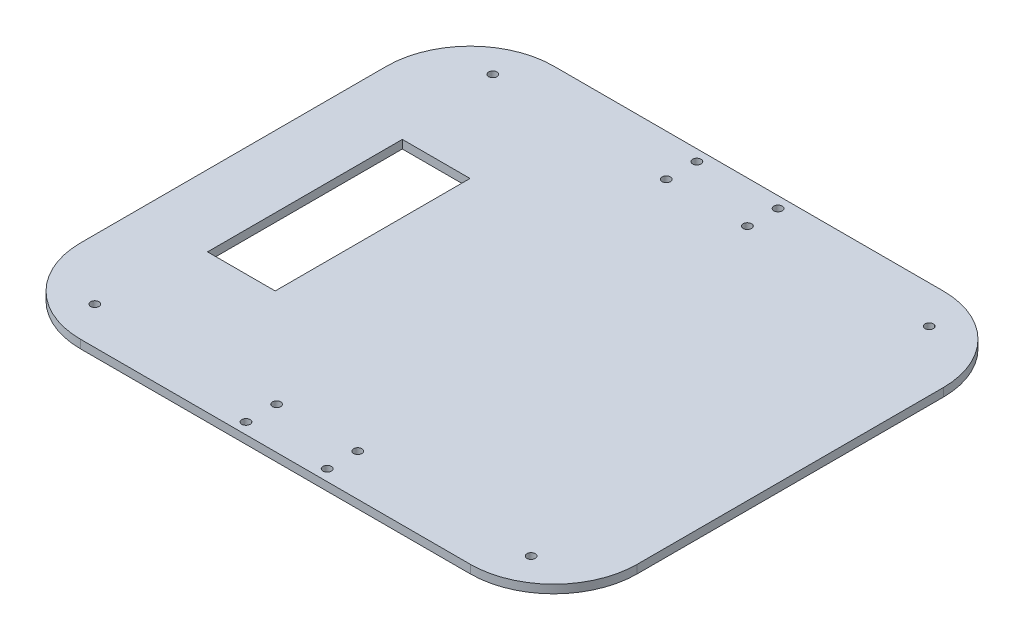
ISO-10303-21;
HEADER;
FILE_DESCRIPTION(('STEP AP214'),'2;1');
FILE_NAME('part.step','',(''),(''),'','','');
FILE_SCHEMA(('AUTOMOTIVE_DESIGN { 1 0 10303 214 1 1 1 1 }'));
ENDSEC;
DATA;
#1=APPLICATION_CONTEXT('core data for automotive mechanical design processes');
#2=APPLICATION_PROTOCOL_DEFINITION('international standard','automotive_design',2000,#1);
#3=PRODUCT_CONTEXT('',#1,'mechanical');
#4=PRODUCT('Part','Part','',(#3));
#5=PRODUCT_RELATED_PRODUCT_CATEGORY('part','',(#4));
#6=PRODUCT_DEFINITION_FORMATION('','',#4);
#7=PRODUCT_DEFINITION_CONTEXT('part definition',#1,'design');
#8=PRODUCT_DEFINITION('design','',#6,#7);
#9=PRODUCT_DEFINITION_SHAPE('','',#8);
#10=(LENGTH_UNIT() NAMED_UNIT(*) SI_UNIT(.MILLI.,.METRE.));
#11=(NAMED_UNIT(*) PLANE_ANGLE_UNIT() SI_UNIT($,.RADIAN.));
#12=(NAMED_UNIT(*) SI_UNIT($,.STERADIAN.) SOLID_ANGLE_UNIT());
#13=UNCERTAINTY_MEASURE_WITH_UNIT(LENGTH_MEASURE(1.E-05),#10,'distance_accuracy_value','');
#14=(GEOMETRIC_REPRESENTATION_CONTEXT(3) GLOBAL_UNCERTAINTY_ASSIGNED_CONTEXT((#13)) GLOBAL_UNIT_ASSIGNED_CONTEXT((#10,
#11,#12)) REPRESENTATION_CONTEXT('',''));
#15=CARTESIAN_POINT('',(0.,0.,0.));
#16=DIRECTION('',(0.,0.,1.));
#17=DIRECTION('',(1.,0.,0.));
#18=AXIS2_PLACEMENT_3D('',#15,#16,#17);
#19=CARTESIAN_POINT('',(100.,3.,-85.));
#20=DIRECTION('',(-1.,0.,0.));
#21=DIRECTION('',(0.,0.,1.));
#22=AXIS2_PLACEMENT_3D('',#19,#20,#21);
#23=PLANE('',#22);
#24=DIRECTION('',(0.,0.,-1.));
#25=VECTOR('',#24,1.);
#26=CARTESIAN_POINT('',(100.,0.,-85.));
#27=LINE('',#26,#25);
#28=CARTESIAN_POINT('',(100.,0.,55.));
#29=VERTEX_POINT('',#28);
#30=CARTESIAN_POINT('',(100.,0.,-55.));
#31=VERTEX_POINT('',#30);
#32=EDGE_CURVE('E158',#29,#31,#27,.T.);
#33=ORIENTED_EDGE('',*,*,#32,.T.);
#34=DIRECTION('',(0.,-1.,0.));
#35=VECTOR('',#34,1.);
#36=CARTESIAN_POINT('',(100.,3.,-55.));
#37=LINE('',#36,#35);
#38=CARTESIAN_POINT('',(100.,3.,-55.));
#39=VERTEX_POINT('',#38);
#40=EDGE_CURVE('E11',#31,#39,#37,.F.);
#41=ORIENTED_EDGE('',*,*,#40,.T.);
#42=DIRECTION('',(0.,0.,-1.));
#43=VECTOR('',#42,1.);
#44=CARTESIAN_POINT('',(100.,3.,-85.));
#45=LINE('',#44,#43);
#46=CARTESIAN_POINT('',(100.,3.,55.));
#47=VERTEX_POINT('',#46);
#48=EDGE_CURVE('E161',#47,#39,#45,.T.);
#49=ORIENTED_EDGE('',*,*,#48,.F.);
#50=DIRECTION('',(0.,-1.,0.));
#51=VECTOR('',#50,1.);
#52=CARTESIAN_POINT('',(100.,3.,55.));
#53=LINE('',#52,#51);
#54=EDGE_CURVE('E44',#47,#29,#53,.T.);
#55=ORIENTED_EDGE('',*,*,#54,.T.);
#56=EDGE_LOOP('',(#33,#41,#49,#55));
#57=FACE_BOUND('',#56,.T.);
#58=ADVANCED_FACE('F36',(#57),#23,.F.);
#59=CARTESIAN_POINT('',(-100.,3.,-85.));
#60=DIRECTION('',(0.,0.,1.));
#61=DIRECTION('',(1.,0.,0.));
#62=AXIS2_PLACEMENT_3D('',#59,#60,#61);
#63=PLANE('',#62);
#64=DIRECTION('',(-1.,0.,0.));
#65=VECTOR('',#64,1.);
#66=CARTESIAN_POINT('',(-100.,0.,-85.));
#67=LINE('',#66,#65);
#68=CARTESIAN_POINT('',(70.,0.,-85.));
#69=VERTEX_POINT('',#68);
#70=CARTESIAN_POINT('',(-70.,0.,-85.));
#71=VERTEX_POINT('',#70);
#72=EDGE_CURVE('E175',#69,#71,#67,.T.);
#73=ORIENTED_EDGE('',*,*,#72,.T.);
#74=DIRECTION('',(0.,-1.,0.));
#75=VECTOR('',#74,1.);
#76=CARTESIAN_POINT('',(-70.,3.,-85.));
#77=LINE('',#76,#75);
#78=CARTESIAN_POINT('',(-70.,3.,-85.));
#79=VERTEX_POINT('',#78);
#80=EDGE_CURVE('E51',#71,#79,#77,.F.);
#81=ORIENTED_EDGE('',*,*,#80,.T.);
#82=DIRECTION('',(-1.,0.,0.));
#83=VECTOR('',#82,1.);
#84=CARTESIAN_POINT('',(-100.,3.,-85.));
#85=LINE('',#84,#83);
#86=CARTESIAN_POINT('',(70.,3.,-85.));
#87=VERTEX_POINT('',#86);
#88=EDGE_CURVE('E163',#87,#79,#85,.T.);
#89=ORIENTED_EDGE('',*,*,#88,.F.);
#90=DIRECTION('',(0.,-1.,0.));
#91=VECTOR('',#90,1.);
#92=CARTESIAN_POINT('',(70.,3.,-85.));
#93=LINE('',#92,#91);
#94=EDGE_CURVE('E254',#87,#69,#93,.T.);
#95=ORIENTED_EDGE('',*,*,#94,.T.);
#96=EDGE_LOOP('',(#73,#81,#89,#95));
#97=FACE_BOUND('',#96,.T.);
#98=ADVANCED_FACE('F272',(#97),#63,.F.);
#99=CARTESIAN_POINT('',(-100.,3.,-85.));
#100=DIRECTION('',(1.,0.,0.));
#101=DIRECTION('',(0.,0.,-1.));
#102=AXIS2_PLACEMENT_3D('',#99,#100,#101);
#103=PLANE('',#102);
#104=DIRECTION('',(0.,0.,1.));
#105=VECTOR('',#104,1.);
#106=CARTESIAN_POINT('',(-100.,0.,-85.));
#107=LINE('',#106,#105);
#108=CARTESIAN_POINT('',(-100.,0.,-55.));
#109=VERTEX_POINT('',#108);
#110=CARTESIAN_POINT('',(-100.,0.,55.));
#111=VERTEX_POINT('',#110);
#112=EDGE_CURVE('E177',#109,#111,#107,.T.);
#113=ORIENTED_EDGE('',*,*,#112,.T.);
#114=DIRECTION('',(0.,-1.,0.));
#115=VECTOR('',#114,1.);
#116=CARTESIAN_POINT('',(-100.,3.,55.));
#117=LINE('',#116,#115);
#118=CARTESIAN_POINT('',(-100.,3.,55.));
#119=VERTEX_POINT('',#118);
#120=EDGE_CURVE('E245',#111,#119,#117,.F.);
#121=ORIENTED_EDGE('',*,*,#120,.T.);
#122=DIRECTION('',(0.,0.,1.));
#123=VECTOR('',#122,1.);
#124=CARTESIAN_POINT('',(-100.,3.,-85.));
#125=LINE('',#124,#123);
#126=CARTESIAN_POINT('',(-100.,3.,-55.));
#127=VERTEX_POINT('',#126);
#128=EDGE_CURVE('E166',#127,#119,#125,.T.);
#129=ORIENTED_EDGE('',*,*,#128,.F.);
#130=DIRECTION('',(0.,-1.,0.));
#131=VECTOR('',#130,1.);
#132=CARTESIAN_POINT('',(-100.,3.,-55.));
#133=LINE('',#132,#131);
#134=EDGE_CURVE('E242',#127,#109,#133,.T.);
#135=ORIENTED_EDGE('',*,*,#134,.T.);
#136=EDGE_LOOP('',(#113,#121,#129,#135));
#137=FACE_BOUND('',#136,.T.);
#138=ADVANCED_FACE('F280',(#137),#103,.F.);
#139=CARTESIAN_POINT('',(-100.,3.,85.));
#140=DIRECTION('',(0.,0.,-1.));
#141=DIRECTION('',(-1.,0.,0.));
#142=AXIS2_PLACEMENT_3D('',#139,#140,#141);
#143=PLANE('',#142);
#144=DIRECTION('',(1.,0.,0.));
#145=VECTOR('',#144,1.);
#146=CARTESIAN_POINT('',(-100.,3.,85.));
#147=LINE('',#146,#145);
#148=CARTESIAN_POINT('',(-70.,3.,85.));
#149=VERTEX_POINT('',#148);
#150=CARTESIAN_POINT('',(70.,3.,85.));
#151=VERTEX_POINT('',#150);
#152=EDGE_CURVE('E169',#149,#151,#147,.T.);
#153=ORIENTED_EDGE('',*,*,#152,.F.);
#154=DIRECTION('',(0.,-1.,0.));
#155=VECTOR('',#154,1.);
#156=CARTESIAN_POINT('',(-70.,3.,85.));
#157=LINE('',#156,#155);
#158=CARTESIAN_POINT('',(-70.,0.,85.));
#159=VERTEX_POINT('',#158);
#160=EDGE_CURVE('E231',#149,#159,#157,.T.);
#161=ORIENTED_EDGE('',*,*,#160,.T.);
#162=DIRECTION('',(1.,0.,0.));
#163=VECTOR('',#162,1.);
#164=CARTESIAN_POINT('',(-100.,0.,85.));
#165=LINE('',#164,#163);
#166=CARTESIAN_POINT('',(70.,0.,85.));
#167=VERTEX_POINT('',#166);
#168=EDGE_CURVE('E164',#159,#167,#165,.T.);
#169=ORIENTED_EDGE('',*,*,#168,.T.);
#170=DIRECTION('',(0.,-1.,0.));
#171=VECTOR('',#170,1.);
#172=CARTESIAN_POINT('',(70.,3.,85.));
#173=LINE('',#172,#171);
#174=EDGE_CURVE('E190',#167,#151,#173,.F.);
#175=ORIENTED_EDGE('',*,*,#174,.T.);
#176=EDGE_LOOP('',(#153,#161,#169,#175));
#177=FACE_BOUND('',#176,.T.);
#178=ADVANCED_FACE('F288',(#177),#143,.F.);
#179=CARTESIAN_POINT('',(0.,3.,0.));
#180=DIRECTION('',(0.,1.,0.));
#181=DIRECTION('',(0.,0.,1.));
#182=AXIS2_PLACEMENT_3D('',#179,#180,#181);
#183=PLANE('',#182);
#184=CARTESIAN_POINT('',(-14.58,3.,-81.));
#185=DIRECTION('',(0.,1.,0.));
#186=DIRECTION('',(0.,0.,-1.));
#187=AXIS2_PLACEMENT_3D('',#184,#185,#186);
#188=CIRCLE('',#187,1.5);
#189=CARTESIAN_POINT('',(-14.58,3.,-82.5));
#190=VERTEX_POINT('',#189);
#191=EDGE_CURVE('E543',#190,#190,#188,.T.);
#192=ORIENTED_EDGE('',*,*,#191,.F.);
#193=EDGE_LOOP('',(#192));
#194=FACE_BOUND('',#193,.T.);
#195=CARTESIAN_POINT('',(14.5800000000001,3.,70.));
#196=DIRECTION('',(0.,1.,0.));
#197=DIRECTION('',(0.,0.,1.));
#198=AXIS2_PLACEMENT_3D('',#195,#196,#197);
#199=CIRCLE('',#198,1.5);
#200=CARTESIAN_POINT('',(14.5800000000001,3.,71.5));
#201=VERTEX_POINT('',#200);
#202=EDGE_CURVE('E547',#201,#201,#199,.T.);
#203=ORIENTED_EDGE('',*,*,#202,.F.);
#204=EDGE_LOOP('',(#203));
#205=FACE_BOUND('',#204,.T.);
#206=CARTESIAN_POINT('',(-14.58,3.,70.));
#207=DIRECTION('',(0.,1.,0.));
#208=DIRECTION('',(0.,0.,-1.));
#209=AXIS2_PLACEMENT_3D('',#206,#207,#208);
#210=CIRCLE('',#209,1.5);
#211=CARTESIAN_POINT('',(-14.58,3.,68.5));
#212=VERTEX_POINT('',#211);
#213=EDGE_CURVE('E551',#212,#212,#210,.T.);
#214=ORIENTED_EDGE('',*,*,#213,.F.);
#215=EDGE_LOOP('',(#214));
#216=FACE_BOUND('',#215,.T.);
#217=CARTESIAN_POINT('',(14.5800000000001,3.,81.));
#218=DIRECTION('',(0.,1.,0.));
#219=DIRECTION('',(0.,0.,-1.));
#220=AXIS2_PLACEMENT_3D('',#217,#218,#219);
#221=CIRCLE('',#220,1.5);
#222=CARTESIAN_POINT('',(14.5800000000001,3.,79.5));
#223=VERTEX_POINT('',#222);
#224=EDGE_CURVE('E555',#223,#223,#221,.T.);
#225=ORIENTED_EDGE('',*,*,#224,.F.);
#226=EDGE_LOOP('',(#225));
#227=FACE_BOUND('',#226,.T.);
#228=CARTESIAN_POINT('',(14.5800000000001,3.,-70.));
#229=DIRECTION('',(0.,1.,0.));
#230=DIRECTION('',(0.,0.,-1.));
#231=AXIS2_PLACEMENT_3D('',#228,#229,#230);
#232=CIRCLE('',#231,1.5);
#233=CARTESIAN_POINT('',(14.5800000000001,3.,-71.5));
#234=VERTEX_POINT('',#233);
#235=EDGE_CURVE('E559',#234,#234,#232,.T.);
#236=ORIENTED_EDGE('',*,*,#235,.F.);
#237=EDGE_LOOP('',(#236));
#238=FACE_BOUND('',#237,.T.);
#239=CARTESIAN_POINT('',(14.5800000000001,3.,-81.));
#240=DIRECTION('',(0.,1.,0.));
#241=DIRECTION('',(0.,0.,1.));
#242=AXIS2_PLACEMENT_3D('',#239,#240,#241);
#243=CIRCLE('',#242,1.5);
#244=CARTESIAN_POINT('',(14.5800000000001,3.,-79.5));
#245=VERTEX_POINT('',#244);
#246=EDGE_CURVE('E563',#245,#245,#243,.T.);
#247=ORIENTED_EDGE('',*,*,#246,.F.);
#248=EDGE_LOOP('',(#247));
#249=FACE_BOUND('',#248,.T.);
#250=CARTESIAN_POINT('',(-14.58,3.,-70.));
#251=DIRECTION('',(0.,1.,0.));
#252=DIRECTION('',(0.,0.,1.));
#253=AXIS2_PLACEMENT_3D('',#250,#251,#252);
#254=CIRCLE('',#253,1.5);
#255=CARTESIAN_POINT('',(-14.58,3.,-68.5));
#256=VERTEX_POINT('',#255);
#257=EDGE_CURVE('E567',#256,#256,#254,.T.);
#258=ORIENTED_EDGE('',*,*,#257,.F.);
#259=EDGE_LOOP('',(#258));
#260=FACE_BOUND('',#259,.T.);
#261=CARTESIAN_POINT('',(-14.58,3.,81.));
#262=DIRECTION('',(0.,1.,0.));
#263=DIRECTION('',(0.,0.,1.));
#264=AXIS2_PLACEMENT_3D('',#261,#262,#263);
#265=CIRCLE('',#264,1.5);
#266=CARTESIAN_POINT('',(-14.58,3.,82.5));
#267=VERTEX_POINT('',#266);
#268=EDGE_CURVE('E208',#267,#267,#265,.T.);
#269=ORIENTED_EDGE('',*,*,#268,.F.);
#270=EDGE_LOOP('',(#269));
#271=FACE_BOUND('',#270,.T.);
#272=CARTESIAN_POINT('',(78.3800000000001,3.,71.5));
#273=DIRECTION('',(0.,1.,0.));
#274=DIRECTION('',(0.,0.,-1.));
#275=AXIS2_PLACEMENT_3D('',#272,#273,#274);
#276=CIRCLE('',#275,1.5);
#277=CARTESIAN_POINT('',(78.3800000000001,3.,70.));
#278=VERTEX_POINT('',#277);
#279=EDGE_CURVE('E229',#278,#278,#276,.T.);
#280=ORIENTED_EDGE('',*,*,#279,.F.);
#281=EDGE_LOOP('',(#280));
#282=FACE_BOUND('',#281,.T.);
#283=CARTESIAN_POINT('',(78.38,3.,-71.5000000000001));
#284=DIRECTION('',(0.,1.,0.));
#285=DIRECTION('',(0.,0.,1.));
#286=AXIS2_PLACEMENT_3D('',#283,#284,#285);
#287=CIRCLE('',#286,1.5);
#288=CARTESIAN_POINT('',(78.38,3.,-70.0000000000001));
#289=VERTEX_POINT('',#288);
#290=EDGE_CURVE('E577',#289,#289,#287,.T.);
#291=ORIENTED_EDGE('',*,*,#290,.F.);
#292=EDGE_LOOP('',(#291));
#293=FACE_BOUND('',#292,.T.);
#294=CARTESIAN_POINT('',(-78.38,3.,-71.5));
#295=DIRECTION('',(0.,1.,0.));
#296=DIRECTION('',(0.,0.,-1.));
#297=AXIS2_PLACEMENT_3D('',#294,#295,#296);
#298=CIRCLE('',#297,1.5);
#299=CARTESIAN_POINT('',(-78.38,3.,-73.));
#300=VERTEX_POINT('',#299);
#301=EDGE_CURVE('E581',#300,#300,#298,.T.);
#302=ORIENTED_EDGE('',*,*,#301,.F.);
#303=EDGE_LOOP('',(#302));
#304=FACE_BOUND('',#303,.T.);
#305=CARTESIAN_POINT('',(-78.38,3.,71.5));
#306=DIRECTION('',(0.,1.,0.));
#307=DIRECTION('',(0.,0.,1.));
#308=AXIS2_PLACEMENT_3D('',#305,#306,#307);
#309=CIRCLE('',#308,1.5);
#310=CARTESIAN_POINT('',(-78.38,3.,73.));
#311=VERTEX_POINT('',#310);
#312=EDGE_CURVE('E195',#311,#311,#309,.T.);
#313=ORIENTED_EDGE('',*,*,#312,.F.);
#314=EDGE_LOOP('',(#313));
#315=FACE_BOUND('',#314,.T.);
#316=DIRECTION('',(0.,0.,-1.));
#317=VECTOR('',#316,1.);
#318=CARTESIAN_POINT('',(-50.0787742574857,3.,-34.9999999999999));
#319=LINE('',#318,#317);
#320=CARTESIAN_POINT('',(-50.0787742574857,3.,35.0000000000001));
#321=VERTEX_POINT('',#320);
#322=CARTESIAN_POINT('',(-50.0787742574857,3.,-34.9999999999999));
#323=VERTEX_POINT('',#322);
#324=EDGE_CURVE('E147',#321,#323,#319,.T.);
#325=ORIENTED_EDGE('',*,*,#324,.F.);
#326=DIRECTION('',(1.,0.,0.));
#327=VECTOR('',#326,1.);
#328=CARTESIAN_POINT('',(-74.4006095549707,3.,35.0000000000001));
#329=LINE('',#328,#327);
#330=CARTESIAN_POINT('',(-74.4006095549707,3.,35.0000000000001));
#331=VERTEX_POINT('',#330);
#332=EDGE_CURVE('E151',#331,#321,#329,.T.);
#333=ORIENTED_EDGE('',*,*,#332,.F.);
#334=DIRECTION('',(0.,0.,1.));
#335=VECTOR('',#334,1.);
#336=CARTESIAN_POINT('',(-74.4006095549707,3.,-34.9999999999999));
#337=LINE('',#336,#335);
#338=CARTESIAN_POINT('',(-74.4006095549707,3.,-34.9999999999999));
#339=VERTEX_POINT('',#338);
#340=EDGE_CURVE('E131',#339,#331,#337,.T.);
#341=ORIENTED_EDGE('',*,*,#340,.F.);
#342=DIRECTION('',(-1.,0.,0.));
#343=VECTOR('',#342,1.);
#344=CARTESIAN_POINT('',(-74.4006095549707,3.,-34.9999999999999));
#345=LINE('',#344,#343);
#346=EDGE_CURVE('E142',#323,#339,#345,.T.);
#347=ORIENTED_EDGE('',*,*,#346,.F.);
#348=EDGE_LOOP('',(#325,#333,#341,#347));
#349=FACE_BOUND('',#348,.T.);
#350=ORIENTED_EDGE('',*,*,#128,.T.);
#351=CARTESIAN_POINT('',(-70.,3.,55.));
#352=DIRECTION('',(0.,1.,0.));
#353=DIRECTION('',(0.,0.,1.));
#354=AXIS2_PLACEMENT_3D('',#351,#352,#353);
#355=CIRCLE('',#354,30.);
#356=EDGE_CURVE('E252',#119,#149,#355,.T.);
#357=ORIENTED_EDGE('',*,*,#356,.T.);
#358=ORIENTED_EDGE('',*,*,#152,.T.);
#359=CARTESIAN_POINT('',(70.,3.,55.));
#360=DIRECTION('',(0.,1.,0.));
#361=DIRECTION('',(0.,0.,1.));
#362=AXIS2_PLACEMENT_3D('',#359,#360,#361);
#363=CIRCLE('',#362,30.);
#364=EDGE_CURVE('E247',#151,#47,#363,.T.);
#365=ORIENTED_EDGE('',*,*,#364,.T.);
#366=ORIENTED_EDGE('',*,*,#48,.T.);
#367=CARTESIAN_POINT('',(70.,3.,-55.));
#368=DIRECTION('',(0.,1.,0.));
#369=DIRECTION('',(0.,0.,1.));
#370=AXIS2_PLACEMENT_3D('',#367,#368,#369);
#371=CIRCLE('',#370,30.);
#372=EDGE_CURVE('E58',#39,#87,#371,.T.);
#373=ORIENTED_EDGE('',*,*,#372,.T.);
#374=ORIENTED_EDGE('',*,*,#88,.T.);
#375=CARTESIAN_POINT('',(-70.,3.,-55.));
#376=DIRECTION('',(0.,1.,0.));
#377=DIRECTION('',(0.,0.,1.));
#378=AXIS2_PLACEMENT_3D('',#375,#376,#377);
#379=CIRCLE('',#378,30.);
#380=EDGE_CURVE('E250',#79,#127,#379,.T.);
#381=ORIENTED_EDGE('',*,*,#380,.T.);
#382=EDGE_LOOP('',(#350,#357,#358,#365,#366,#373,#374,#381));
#383=FACE_BOUND('',#382,.T.);
#384=ADVANCED_FACE('F149',(#194,#205,#216,#227,#238,#249,#260,#271,#282,#293,#304,#315,#349,
#383),#183,.T.);
#385=CARTESIAN_POINT('',(0.,0.,0.));
#386=DIRECTION('',(0.,1.,0.));
#387=DIRECTION('',(0.,0.,1.));
#388=AXIS2_PLACEMENT_3D('',#385,#386,#387);
#389=PLANE('',#388);
#390=CARTESIAN_POINT('',(-14.58,0.,-81.));
#391=DIRECTION('',(0.,1.,0.));
#392=DIRECTION('',(0.,0.,1.));
#393=AXIS2_PLACEMENT_3D('',#390,#391,#392);
#394=CIRCLE('',#393,1.5);
#395=CARTESIAN_POINT('',(-14.58,0.,-79.5));
#396=VERTEX_POINT('',#395);
#397=EDGE_CURVE('E226',#396,#396,#394,.T.);
#398=ORIENTED_EDGE('',*,*,#397,.T.);
#399=EDGE_LOOP('',(#398));
#400=FACE_BOUND('',#399,.T.);
#401=CARTESIAN_POINT('',(14.5800000000001,0.,70.));
#402=DIRECTION('',(0.,1.,0.));
#403=DIRECTION('',(0.,0.,1.));
#404=AXIS2_PLACEMENT_3D('',#401,#402,#403);
#405=CIRCLE('',#404,1.5);
#406=CARTESIAN_POINT('',(14.5800000000001,0.,71.5));
#407=VERTEX_POINT('',#406);
#408=EDGE_CURVE('E223',#407,#407,#405,.T.);
#409=ORIENTED_EDGE('',*,*,#408,.T.);
#410=EDGE_LOOP('',(#409));
#411=FACE_BOUND('',#410,.T.);
#412=CARTESIAN_POINT('',(-14.58,0.,70.));
#413=DIRECTION('',(0.,1.,0.));
#414=DIRECTION('',(0.,0.,1.));
#415=AXIS2_PLACEMENT_3D('',#412,#413,#414);
#416=CIRCLE('',#415,1.5);
#417=CARTESIAN_POINT('',(-14.58,0.,71.5));
#418=VERTEX_POINT('',#417);
#419=EDGE_CURVE('E220',#418,#418,#416,.T.);
#420=ORIENTED_EDGE('',*,*,#419,.T.);
#421=EDGE_LOOP('',(#420));
#422=FACE_BOUND('',#421,.T.);
#423=CARTESIAN_POINT('',(14.5800000000001,0.,81.));
#424=DIRECTION('',(0.,1.,0.));
#425=DIRECTION('',(0.,0.,1.));
#426=AXIS2_PLACEMENT_3D('',#423,#424,#425);
#427=CIRCLE('',#426,1.5);
#428=CARTESIAN_POINT('',(14.5800000000001,0.,82.5));
#429=VERTEX_POINT('',#428);
#430=EDGE_CURVE('E217',#429,#429,#427,.T.);
#431=ORIENTED_EDGE('',*,*,#430,.T.);
#432=EDGE_LOOP('',(#431));
#433=FACE_BOUND('',#432,.T.);
#434=CARTESIAN_POINT('',(14.5800000000001,0.,-70.));
#435=DIRECTION('',(0.,1.,0.));
#436=DIRECTION('',(0.,0.,1.));
#437=AXIS2_PLACEMENT_3D('',#434,#435,#436);
#438=CIRCLE('',#437,1.5);
#439=CARTESIAN_POINT('',(14.5800000000001,0.,-68.5));
#440=VERTEX_POINT('',#439);
#441=EDGE_CURVE('E214',#440,#440,#438,.T.);
#442=ORIENTED_EDGE('',*,*,#441,.T.);
#443=EDGE_LOOP('',(#442));
#444=FACE_BOUND('',#443,.T.);
#445=CARTESIAN_POINT('',(14.5800000000001,0.,-81.));
#446=DIRECTION('',(0.,1.,0.));
#447=DIRECTION('',(0.,0.,1.));
#448=AXIS2_PLACEMENT_3D('',#445,#446,#447);
#449=CIRCLE('',#448,1.5);
#450=CARTESIAN_POINT('',(14.5800000000001,0.,-79.5));
#451=VERTEX_POINT('',#450);
#452=EDGE_CURVE('E211',#451,#451,#449,.T.);
#453=ORIENTED_EDGE('',*,*,#452,.T.);
#454=EDGE_LOOP('',(#453));
#455=FACE_BOUND('',#454,.T.);
#456=CARTESIAN_POINT('',(-14.58,0.,-70.));
#457=DIRECTION('',(0.,1.,0.));
#458=DIRECTION('',(0.,0.,1.));
#459=AXIS2_PLACEMENT_3D('',#456,#457,#458);
#460=CIRCLE('',#459,1.5);
#461=CARTESIAN_POINT('',(-14.58,0.,-68.5));
#462=VERTEX_POINT('',#461);
#463=EDGE_CURVE('E207',#462,#462,#460,.T.);
#464=ORIENTED_EDGE('',*,*,#463,.T.);
#465=EDGE_LOOP('',(#464));
#466=FACE_BOUND('',#465,.T.);
#467=CARTESIAN_POINT('',(-14.58,0.,81.));
#468=DIRECTION('',(0.,1.,0.));
#469=DIRECTION('',(0.,0.,1.));
#470=AXIS2_PLACEMENT_3D('',#467,#468,#469);
#471=CIRCLE('',#470,1.5);
#472=CARTESIAN_POINT('',(-14.58,0.,82.5));
#473=VERTEX_POINT('',#472);
#474=EDGE_CURVE('E204',#473,#473,#471,.T.);
#475=ORIENTED_EDGE('',*,*,#474,.T.);
#476=EDGE_LOOP('',(#475));
#477=FACE_BOUND('',#476,.T.);
#478=CARTESIAN_POINT('',(78.3800000000001,0.,71.5));
#479=DIRECTION('',(0.,1.,0.));
#480=DIRECTION('',(0.,0.,1.));
#481=AXIS2_PLACEMENT_3D('',#478,#479,#480);
#482=CIRCLE('',#481,1.5);
#483=CARTESIAN_POINT('',(78.3800000000001,0.,73.));
#484=VERTEX_POINT('',#483);
#485=EDGE_CURVE('E201',#484,#484,#482,.T.);
#486=ORIENTED_EDGE('',*,*,#485,.T.);
#487=EDGE_LOOP('',(#486));
#488=FACE_BOUND('',#487,.T.);
#489=CARTESIAN_POINT('',(78.38,0.,-71.5000000000001));
#490=DIRECTION('',(0.,1.,0.));
#491=DIRECTION('',(0.,0.,1.));
#492=AXIS2_PLACEMENT_3D('',#489,#490,#491);
#493=CIRCLE('',#492,1.5);
#494=CARTESIAN_POINT('',(78.38,0.,-70.0000000000001));
#495=VERTEX_POINT('',#494);
#496=EDGE_CURVE('E198',#495,#495,#493,.T.);
#497=ORIENTED_EDGE('',*,*,#496,.T.);
#498=EDGE_LOOP('',(#497));
#499=FACE_BOUND('',#498,.T.);
#500=CARTESIAN_POINT('',(-78.38,0.,-71.5));
#501=DIRECTION('',(0.,1.,0.));
#502=DIRECTION('',(0.,0.,1.));
#503=AXIS2_PLACEMENT_3D('',#500,#501,#502);
#504=CIRCLE('',#503,1.5);
#505=CARTESIAN_POINT('',(-78.38,0.,-70.));
#506=VERTEX_POINT('',#505);
#507=EDGE_CURVE('E194',#506,#506,#504,.T.);
#508=ORIENTED_EDGE('',*,*,#507,.T.);
#509=EDGE_LOOP('',(#508));
#510=FACE_BOUND('',#509,.T.);
#511=CARTESIAN_POINT('',(-78.38,0.,71.5));
#512=DIRECTION('',(0.,1.,0.));
#513=DIRECTION('',(0.,0.,1.));
#514=AXIS2_PLACEMENT_3D('',#511,#512,#513);
#515=CIRCLE('',#514,1.5);
#516=CARTESIAN_POINT('',(-78.38,0.,73.));
#517=VERTEX_POINT('',#516);
#518=EDGE_CURVE('E191',#517,#517,#515,.T.);
#519=ORIENTED_EDGE('',*,*,#518,.T.);
#520=EDGE_LOOP('',(#519));
#521=FACE_BOUND('',#520,.T.);
#522=DIRECTION('',(1.,0.,0.));
#523=VECTOR('',#522,1.);
#524=CARTESIAN_POINT('',(0.,0.,35.0000000000001));
#525=LINE('',#524,#523);
#526=CARTESIAN_POINT('',(-74.4006095549707,0.,35.0000000000001));
#527=VERTEX_POINT('',#526);
#528=CARTESIAN_POINT('',(-50.0787742574857,0.,35.0000000000001));
#529=VERTEX_POINT('',#528);
#530=EDGE_CURVE('E184',#527,#529,#525,.T.);
#531=ORIENTED_EDGE('',*,*,#530,.T.);
#532=DIRECTION('',(0.,0.,-1.));
#533=VECTOR('',#532,1.);
#534=CARTESIAN_POINT('',(-50.0787742574857,0.,0.));
#535=LINE('',#534,#533);
#536=CARTESIAN_POINT('',(-50.0787742574857,0.,-34.9999999999999));
#537=VERTEX_POINT('',#536);
#538=EDGE_CURVE('E187',#529,#537,#535,.T.);
#539=ORIENTED_EDGE('',*,*,#538,.T.);
#540=DIRECTION('',(-1.,0.,0.));
#541=VECTOR('',#540,1.);
#542=CARTESIAN_POINT('',(0.,0.,-35.));
#543=LINE('',#542,#541);
#544=CARTESIAN_POINT('',(-74.4006095549707,0.,-34.9999999999999));
#545=VERTEX_POINT('',#544);
#546=EDGE_CURVE('E172',#537,#545,#543,.T.);
#547=ORIENTED_EDGE('',*,*,#546,.T.);
#548=DIRECTION('',(0.,0.,1.));
#549=VECTOR('',#548,1.);
#550=CARTESIAN_POINT('',(-74.4006095549707,0.,0.));
#551=LINE('',#550,#549);
#552=EDGE_CURVE('E134',#545,#527,#551,.T.);
#553=ORIENTED_EDGE('',*,*,#552,.T.);
#554=EDGE_LOOP('',(#531,#539,#547,#553));
#555=FACE_BOUND('',#554,.T.);
#556=ORIENTED_EDGE('',*,*,#168,.F.);
#557=CARTESIAN_POINT('',(-70.,0.,55.));
#558=DIRECTION('',(0.,1.,0.));
#559=DIRECTION('',(0.,0.,1.));
#560=AXIS2_PLACEMENT_3D('',#557,#558,#559);
#561=CIRCLE('',#560,30.);
#562=EDGE_CURVE('E240',#159,#111,#561,.F.);
#563=ORIENTED_EDGE('',*,*,#562,.T.);
#564=ORIENTED_EDGE('',*,*,#112,.F.);
#565=CARTESIAN_POINT('',(-70.,0.,-55.));
#566=DIRECTION('',(0.,1.,0.));
#567=DIRECTION('',(0.,0.,1.));
#568=AXIS2_PLACEMENT_3D('',#565,#566,#567);
#569=CIRCLE('',#568,30.);
#570=EDGE_CURVE('E238',#109,#71,#569,.F.);
#571=ORIENTED_EDGE('',*,*,#570,.T.);
#572=ORIENTED_EDGE('',*,*,#72,.F.);
#573=CARTESIAN_POINT('',(70.,0.,-55.));
#574=DIRECTION('',(0.,1.,0.));
#575=DIRECTION('',(0.,0.,1.));
#576=AXIS2_PLACEMENT_3D('',#573,#574,#575);
#577=CIRCLE('',#576,30.);
#578=EDGE_CURVE('E236',#69,#31,#577,.F.);
#579=ORIENTED_EDGE('',*,*,#578,.T.);
#580=ORIENTED_EDGE('',*,*,#32,.F.);
#581=CARTESIAN_POINT('',(70.,0.,55.));
#582=DIRECTION('',(0.,1.,0.));
#583=DIRECTION('',(0.,0.,1.));
#584=AXIS2_PLACEMENT_3D('',#581,#582,#583);
#585=CIRCLE('',#584,30.);
#586=EDGE_CURVE('E234',#29,#167,#585,.F.);
#587=ORIENTED_EDGE('',*,*,#586,.T.);
#588=EDGE_LOOP('',(#556,#563,#564,#571,#572,#579,#580,#587));
#589=FACE_BOUND('',#588,.T.);
#590=ADVANCED_FACE('F267',(#400,#411,#422,#433,#444,#455,#466,#477,#488,#499,#510,#521,#555,
#589),#389,.F.);
#591=CARTESIAN_POINT('',(-50.0787742574857,-97.,-34.9999999999999));
#592=DIRECTION('',(1.,0.,0.));
#593=DIRECTION('',(0.,0.,-1.));
#594=AXIS2_PLACEMENT_3D('',#591,#592,#593);
#595=PLANE('',#594);
#596=DIRECTION('',(0.,1.,0.));
#597=VECTOR('',#596,1.);
#598=CARTESIAN_POINT('',(-50.0787742574857,-97.,35.0000000000001));
#599=LINE('',#598,#597);
#600=EDGE_CURVE('E156',#529,#321,#599,.T.);
#601=ORIENTED_EDGE('',*,*,#600,.T.);
#602=ORIENTED_EDGE('',*,*,#324,.T.);
#603=DIRECTION('',(0.,1.,0.));
#604=VECTOR('',#603,1.);
#605=CARTESIAN_POINT('',(-50.0787742574857,-97.,-34.9999999999999));
#606=LINE('',#605,#604);
#607=EDGE_CURVE('E138',#537,#323,#606,.T.);
#608=ORIENTED_EDGE('',*,*,#607,.F.);
#609=ORIENTED_EDGE('',*,*,#538,.F.);
#610=EDGE_LOOP('',(#601,#602,#608,#609));
#611=FACE_BOUND('',#610,.T.);
#612=ADVANCED_FACE('F457',(#611),#595,.F.);
#613=CARTESIAN_POINT('',(-74.4006095549707,-97.,35.0000000000001));
#614=DIRECTION('',(0.,0.,1.));
#615=DIRECTION('',(1.,0.,0.));
#616=AXIS2_PLACEMENT_3D('',#613,#614,#615);
#617=PLANE('',#616);
#618=DIRECTION('',(0.,1.,0.));
#619=VECTOR('',#618,1.);
#620=CARTESIAN_POINT('',(-74.4006095549707,-97.,35.0000000000001));
#621=LINE('',#620,#619);
#622=EDGE_CURVE('E137',#527,#331,#621,.T.);
#623=ORIENTED_EDGE('',*,*,#622,.T.);
#624=ORIENTED_EDGE('',*,*,#332,.T.);
#625=ORIENTED_EDGE('',*,*,#600,.F.);
#626=ORIENTED_EDGE('',*,*,#530,.F.);
#627=EDGE_LOOP('',(#623,#624,#625,#626));
#628=FACE_BOUND('',#627,.T.);
#629=ADVANCED_FACE('F449',(#628),#617,.F.);
#630=CARTESIAN_POINT('',(-74.4006095549707,-97.,-34.9999999999999));
#631=DIRECTION('',(-1.,0.,0.));
#632=DIRECTION('',(0.,0.,1.));
#633=AXIS2_PLACEMENT_3D('',#630,#631,#632);
#634=PLANE('',#633);
#635=DIRECTION('',(0.,1.,0.));
#636=VECTOR('',#635,1.);
#637=CARTESIAN_POINT('',(-74.4006095549707,-97.,-34.9999999999999));
#638=LINE('',#637,#636);
#639=EDGE_CURVE('E126',#545,#339,#638,.T.);
#640=ORIENTED_EDGE('',*,*,#639,.T.);
#641=ORIENTED_EDGE('',*,*,#340,.T.);
#642=ORIENTED_EDGE('',*,*,#622,.F.);
#643=ORIENTED_EDGE('',*,*,#552,.F.);
#644=EDGE_LOOP('',(#640,#641,#642,#643));
#645=FACE_BOUND('',#644,.T.);
#646=ADVANCED_FACE('F128',(#645),#634,.F.);
#647=CARTESIAN_POINT('',(-74.4006095549707,-97.,-34.9999999999999));
#648=DIRECTION('',(0.,0.,-1.));
#649=DIRECTION('',(-1.,0.,0.));
#650=AXIS2_PLACEMENT_3D('',#647,#648,#649);
#651=PLANE('',#650);
#652=ORIENTED_EDGE('',*,*,#607,.T.);
#653=ORIENTED_EDGE('',*,*,#346,.T.);
#654=ORIENTED_EDGE('',*,*,#639,.F.);
#655=ORIENTED_EDGE('',*,*,#546,.F.);
#656=EDGE_LOOP('',(#652,#653,#654,#655));
#657=FACE_BOUND('',#656,.T.);
#658=ADVANCED_FACE('F143',(#657),#651,.F.);
#659=CARTESIAN_POINT('',(-78.38,-97.,71.5));
#660=DIRECTION('',(0.,1.,0.));
#661=DIRECTION('',(0.,0.,1.));
#662=AXIS2_PLACEMENT_3D('',#659,#660,#661);
#663=CYLINDRICAL_SURFACE('',#662,1.5);
#664=ORIENTED_EDGE('',*,*,#312,.T.);
#665=EDGE_LOOP('',(#664));
#666=FACE_BOUND('',#665,.T.);
#667=ORIENTED_EDGE('',*,*,#518,.F.);
#668=EDGE_LOOP('',(#667));
#669=FACE_BOUND('',#668,.T.);
#670=ADVANCED_FACE('F425',(#666,#669),#663,.F.);
#671=CARTESIAN_POINT('',(-78.38,-97.,-71.5));
#672=DIRECTION('',(0.,1.,0.));
#673=DIRECTION('',(0.,0.,1.));
#674=AXIS2_PLACEMENT_3D('',#671,#672,#673);
#675=CYLINDRICAL_SURFACE('',#674,1.5);
#676=ORIENTED_EDGE('',*,*,#301,.T.);
#677=EDGE_LOOP('',(#676));
#678=FACE_BOUND('',#677,.T.);
#679=ORIENTED_EDGE('',*,*,#507,.F.);
#680=EDGE_LOOP('',(#679));
#681=FACE_BOUND('',#680,.T.);
#682=ADVANCED_FACE('F416',(#678,#681),#675,.F.);
#683=CARTESIAN_POINT('',(78.38,-97.,-71.5000000000001));
#684=DIRECTION('',(0.,1.,0.));
#685=DIRECTION('',(0.,0.,1.));
#686=AXIS2_PLACEMENT_3D('',#683,#684,#685);
#687=CYLINDRICAL_SURFACE('',#686,1.5);
#688=ORIENTED_EDGE('',*,*,#290,.T.);
#689=EDGE_LOOP('',(#688));
#690=FACE_BOUND('',#689,.T.);
#691=ORIENTED_EDGE('',*,*,#496,.F.);
#692=EDGE_LOOP('',(#691));
#693=FACE_BOUND('',#692,.T.);
#694=ADVANCED_FACE('F407',(#690,#693),#687,.F.);
#695=CARTESIAN_POINT('',(78.3800000000001,-97.,71.5));
#696=DIRECTION('',(0.,1.,0.));
#697=DIRECTION('',(0.,0.,1.));
#698=AXIS2_PLACEMENT_3D('',#695,#696,#697);
#699=CYLINDRICAL_SURFACE('',#698,1.5);
#700=ORIENTED_EDGE('',*,*,#279,.T.);
#701=EDGE_LOOP('',(#700));
#702=FACE_BOUND('',#701,.T.);
#703=ORIENTED_EDGE('',*,*,#485,.F.);
#704=EDGE_LOOP('',(#703));
#705=FACE_BOUND('',#704,.T.);
#706=ADVANCED_FACE('F398',(#702,#705),#699,.F.);
#707=CARTESIAN_POINT('',(-14.58,-97.,81.));
#708=DIRECTION('',(0.,1.,0.));
#709=DIRECTION('',(0.,0.,1.));
#710=AXIS2_PLACEMENT_3D('',#707,#708,#709);
#711=CYLINDRICAL_SURFACE('',#710,1.5);
#712=ORIENTED_EDGE('',*,*,#268,.T.);
#713=EDGE_LOOP('',(#712));
#714=FACE_BOUND('',#713,.T.);
#715=ORIENTED_EDGE('',*,*,#474,.F.);
#716=EDGE_LOOP('',(#715));
#717=FACE_BOUND('',#716,.T.);
#718=ADVANCED_FACE('F389',(#714,#717),#711,.F.);
#719=CARTESIAN_POINT('',(-14.58,-97.,-70.));
#720=DIRECTION('',(0.,1.,0.));
#721=DIRECTION('',(0.,0.,1.));
#722=AXIS2_PLACEMENT_3D('',#719,#720,#721);
#723=CYLINDRICAL_SURFACE('',#722,1.5);
#724=ORIENTED_EDGE('',*,*,#257,.T.);
#725=EDGE_LOOP('',(#724));
#726=FACE_BOUND('',#725,.T.);
#727=ORIENTED_EDGE('',*,*,#463,.F.);
#728=EDGE_LOOP('',(#727));
#729=FACE_BOUND('',#728,.T.);
#730=ADVANCED_FACE('F380',(#726,#729),#723,.F.);
#731=CARTESIAN_POINT('',(14.5800000000001,-97.,-81.));
#732=DIRECTION('',(0.,1.,0.));
#733=DIRECTION('',(0.,0.,1.));
#734=AXIS2_PLACEMENT_3D('',#731,#732,#733);
#735=CYLINDRICAL_SURFACE('',#734,1.5);
#736=ORIENTED_EDGE('',*,*,#246,.T.);
#737=EDGE_LOOP('',(#736));
#738=FACE_BOUND('',#737,.T.);
#739=ORIENTED_EDGE('',*,*,#452,.F.);
#740=EDGE_LOOP('',(#739));
#741=FACE_BOUND('',#740,.T.);
#742=ADVANCED_FACE('F371',(#738,#741),#735,.F.);
#743=CARTESIAN_POINT('',(14.5800000000001,-97.,-70.));
#744=DIRECTION('',(0.,1.,0.));
#745=DIRECTION('',(0.,0.,1.));
#746=AXIS2_PLACEMENT_3D('',#743,#744,#745);
#747=CYLINDRICAL_SURFACE('',#746,1.5);
#748=ORIENTED_EDGE('',*,*,#235,.T.);
#749=EDGE_LOOP('',(#748));
#750=FACE_BOUND('',#749,.T.);
#751=ORIENTED_EDGE('',*,*,#441,.F.);
#752=EDGE_LOOP('',(#751));
#753=FACE_BOUND('',#752,.T.);
#754=ADVANCED_FACE('F362',(#750,#753),#747,.F.);
#755=CARTESIAN_POINT('',(14.5800000000001,-97.,81.));
#756=DIRECTION('',(0.,1.,0.));
#757=DIRECTION('',(0.,0.,1.));
#758=AXIS2_PLACEMENT_3D('',#755,#756,#757);
#759=CYLINDRICAL_SURFACE('',#758,1.5);
#760=ORIENTED_EDGE('',*,*,#224,.T.);
#761=EDGE_LOOP('',(#760));
#762=FACE_BOUND('',#761,.T.);
#763=ORIENTED_EDGE('',*,*,#430,.F.);
#764=EDGE_LOOP('',(#763));
#765=FACE_BOUND('',#764,.T.);
#766=ADVANCED_FACE('F353',(#762,#765),#759,.F.);
#767=CARTESIAN_POINT('',(-14.58,-97.,70.));
#768=DIRECTION('',(0.,1.,0.));
#769=DIRECTION('',(0.,0.,1.));
#770=AXIS2_PLACEMENT_3D('',#767,#768,#769);
#771=CYLINDRICAL_SURFACE('',#770,1.5);
#772=ORIENTED_EDGE('',*,*,#213,.T.);
#773=EDGE_LOOP('',(#772));
#774=FACE_BOUND('',#773,.T.);
#775=ORIENTED_EDGE('',*,*,#419,.F.);
#776=EDGE_LOOP('',(#775));
#777=FACE_BOUND('',#776,.T.);
#778=ADVANCED_FACE('F344',(#774,#777),#771,.F.);
#779=CARTESIAN_POINT('',(14.5800000000001,-97.,70.));
#780=DIRECTION('',(0.,1.,0.));
#781=DIRECTION('',(0.,0.,1.));
#782=AXIS2_PLACEMENT_3D('',#779,#780,#781);
#783=CYLINDRICAL_SURFACE('',#782,1.5);
#784=ORIENTED_EDGE('',*,*,#202,.T.);
#785=EDGE_LOOP('',(#784));
#786=FACE_BOUND('',#785,.T.);
#787=ORIENTED_EDGE('',*,*,#408,.F.);
#788=EDGE_LOOP('',(#787));
#789=FACE_BOUND('',#788,.T.);
#790=ADVANCED_FACE('F335',(#786,#789),#783,.F.);
#791=CARTESIAN_POINT('',(-14.58,-97.,-81.));
#792=DIRECTION('',(0.,1.,0.));
#793=DIRECTION('',(0.,0.,1.));
#794=AXIS2_PLACEMENT_3D('',#791,#792,#793);
#795=CYLINDRICAL_SURFACE('',#794,1.5);
#796=ORIENTED_EDGE('',*,*,#191,.T.);
#797=EDGE_LOOP('',(#796));
#798=FACE_BOUND('',#797,.T.);
#799=ORIENTED_EDGE('',*,*,#397,.F.);
#800=EDGE_LOOP('',(#799));
#801=FACE_BOUND('',#800,.T.);
#802=ADVANCED_FACE('F304',(#798,#801),#795,.F.);
#803=CARTESIAN_POINT('',(-70.,3.,55.));
#804=DIRECTION('',(0.,-1.,0.));
#805=DIRECTION('',(0.,0.,-1.));
#806=AXIS2_PLACEMENT_3D('',#803,#804,#805);
#807=CYLINDRICAL_SURFACE('',#806,30.);
#808=ORIENTED_EDGE('',*,*,#356,.F.);
#809=ORIENTED_EDGE('',*,*,#120,.F.);
#810=ORIENTED_EDGE('',*,*,#562,.F.);
#811=ORIENTED_EDGE('',*,*,#160,.F.);
#812=EDGE_LOOP('',(#808,#809,#810,#811));
#813=FACE_BOUND('',#812,.T.);
#814=ADVANCED_FACE('F285',(#813),#807,.T.);
#815=CARTESIAN_POINT('',(-70.,3.,-55.));
#816=DIRECTION('',(0.,-1.,0.));
#817=DIRECTION('',(0.,0.,-1.));
#818=AXIS2_PLACEMENT_3D('',#815,#816,#817);
#819=CYLINDRICAL_SURFACE('',#818,30.);
#820=ORIENTED_EDGE('',*,*,#380,.F.);
#821=ORIENTED_EDGE('',*,*,#80,.F.);
#822=ORIENTED_EDGE('',*,*,#570,.F.);
#823=ORIENTED_EDGE('',*,*,#134,.F.);
#824=EDGE_LOOP('',(#820,#821,#822,#823));
#825=FACE_BOUND('',#824,.T.);
#826=ADVANCED_FACE('F277',(#825),#819,.T.);
#827=CARTESIAN_POINT('',(70.,3.,-55.));
#828=DIRECTION('',(0.,-1.,0.));
#829=DIRECTION('',(0.,0.,-1.));
#830=AXIS2_PLACEMENT_3D('',#827,#828,#829);
#831=CYLINDRICAL_SURFACE('',#830,30.);
#832=ORIENTED_EDGE('',*,*,#372,.F.);
#833=ORIENTED_EDGE('',*,*,#40,.F.);
#834=ORIENTED_EDGE('',*,*,#578,.F.);
#835=ORIENTED_EDGE('',*,*,#94,.F.);
#836=EDGE_LOOP('',(#832,#833,#834,#835));
#837=FACE_BOUND('',#836,.T.);
#838=ADVANCED_FACE('F271',(#837),#831,.T.);
#839=CARTESIAN_POINT('',(70.,3.,55.));
#840=DIRECTION('',(0.,-1.,0.));
#841=DIRECTION('',(0.,0.,-1.));
#842=AXIS2_PLACEMENT_3D('',#839,#840,#841);
#843=CYLINDRICAL_SURFACE('',#842,30.);
#844=ORIENTED_EDGE('',*,*,#364,.F.);
#845=ORIENTED_EDGE('',*,*,#174,.F.);
#846=ORIENTED_EDGE('',*,*,#586,.F.);
#847=ORIENTED_EDGE('',*,*,#54,.F.);
#848=EDGE_LOOP('',(#844,#845,#846,#847));
#849=FACE_BOUND('',#848,.T.);
#850=ADVANCED_FACE('F38',(#849),#843,.T.);
#851=CLOSED_SHELL('',(#58,#98,#138,#178,#384,#590,#612,#629,#646,#658,#670,#682,#694,#706,#718,
#730,#742,#754,#766,#778,#790,#802,#814,#826,#838,#850));
#852=MANIFOLD_SOLID_BREP('B2',#851);
#853=ADVANCED_BREP_SHAPE_REPRESENTATION('',(#18,#852),#14);
#854=SHAPE_DEFINITION_REPRESENTATION(#9,#853);
ENDSEC;
END-ISO-10303-21;
